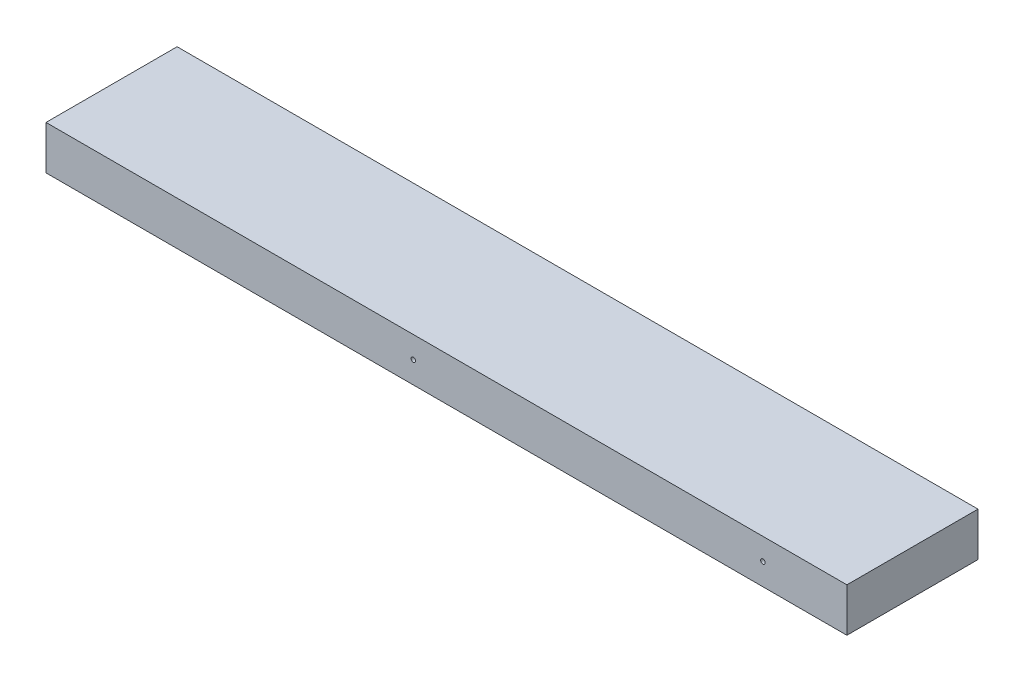
ISO-10303-21;
HEADER;
FILE_DESCRIPTION(('STEP AP214'),'2;1');
FILE_NAME('part.step','',(''),(''),'','','');
FILE_SCHEMA(('AUTOMOTIVE_DESIGN { 1 0 10303 214 1 1 1 1 }'));
ENDSEC;
DATA;
#1=APPLICATION_CONTEXT('core data for automotive mechanical design processes');
#2=APPLICATION_PROTOCOL_DEFINITION('international standard','automotive_design',2000,#1);
#3=PRODUCT_CONTEXT('',#1,'mechanical');
#4=PRODUCT('Part','Part','',(#3));
#5=PRODUCT_RELATED_PRODUCT_CATEGORY('part','',(#4));
#6=PRODUCT_DEFINITION_FORMATION('','',#4);
#7=PRODUCT_DEFINITION_CONTEXT('part definition',#1,'design');
#8=PRODUCT_DEFINITION('design','',#6,#7);
#9=PRODUCT_DEFINITION_SHAPE('','',#8);
#10=(LENGTH_UNIT() NAMED_UNIT(*) SI_UNIT(.MILLI.,.METRE.));
#11=(NAMED_UNIT(*) PLANE_ANGLE_UNIT() SI_UNIT($,.RADIAN.));
#12=(NAMED_UNIT(*) SI_UNIT($,.STERADIAN.) SOLID_ANGLE_UNIT());
#13=UNCERTAINTY_MEASURE_WITH_UNIT(LENGTH_MEASURE(1.E-05),#10,'distance_accuracy_value','');
#14=(GEOMETRIC_REPRESENTATION_CONTEXT(3) GLOBAL_UNCERTAINTY_ASSIGNED_CONTEXT((#13)) GLOBAL_UNIT_ASSIGNED_CONTEXT((#10,
#11,#12)) REPRESENTATION_CONTEXT('',''));
#15=CARTESIAN_POINT('',(0.,0.,0.));
#16=DIRECTION('',(0.,0.,1.));
#17=DIRECTION('',(1.,0.,0.));
#18=AXIS2_PLACEMENT_3D('',#15,#16,#17);
#19=CARTESIAN_POINT('',(-86.3599999999995,5213.35,2683.51));
#20=DIRECTION('',(0.,-1.,0.));
#21=DIRECTION('',(0.,0.,-1.));
#22=AXIS2_PLACEMENT_3D('',#19,#20,#21);
#23=PLANE('',#22);
#24=DIRECTION('',(0.,0.,-1.));
#25=VECTOR('',#24,1.);
#26=CARTESIAN_POINT('',(-96.1779514960055,5213.35,2740.66));
#27=LINE('',#26,#25);
#28=CARTESIAN_POINT('',(-96.1779514960055,5213.35,2740.66));
#29=VERTEX_POINT('',#28);
#30=CARTESIAN_POINT('',(-96.1779514960055,5213.35,2683.51));
#31=VERTEX_POINT('',#30);
#32=EDGE_CURVE('E101',#29,#31,#27,.T.);
#33=ORIENTED_EDGE('',*,*,#32,.F.);
#34=DIRECTION('',(1.,0.,0.));
#35=VECTOR('',#34,1.);
#36=CARTESIAN_POINT('',(-265.815570864871,5213.35,2740.66));
#37=LINE('',#36,#35);
#38=CARTESIAN_POINT('',(-445.271141729743,5213.35,2740.66));
#39=VERTEX_POINT('',#38);
#40=EDGE_CURVE('E106',#39,#29,#37,.T.);
#41=ORIENTED_EDGE('',*,*,#40,.F.);
#42=DIRECTION('',(0.,0.,-1.));
#43=VECTOR('',#42,1.);
#44=CARTESIAN_POINT('',(-445.271141729743,5213.35,2683.51));
#45=LINE('',#44,#43);
#46=CARTESIAN_POINT('',(-445.271141729743,5213.35,2683.51));
#47=VERTEX_POINT('',#46);
#48=EDGE_CURVE('E144',#39,#47,#45,.T.);
#49=ORIENTED_EDGE('',*,*,#48,.T.);
#50=DIRECTION('',(-1.,0.,0.));
#51=VECTOR('',#50,1.);
#52=CARTESIAN_POINT('',(-265.815570864871,5213.35,2683.51));
#53=LINE('',#52,#51);
#54=EDGE_CURVE('E114',#31,#47,#53,.T.);
#55=ORIENTED_EDGE('',*,*,#54,.F.);
#56=EDGE_LOOP('',(#33,#41,#49,#55));
#57=FACE_BOUND('',#56,.T.);
#58=ADVANCED_FACE('F37',(#57),#23,.T.);
#59=CARTESIAN_POINT('',(-265.815570864871,5222.875,2740.66));
#60=DIRECTION('',(0.,0.,-1.));
#61=DIRECTION('',(1.,0.,0.));
#62=AXIS2_PLACEMENT_3D('',#59,#60,#61);
#63=PLANE('',#62);
#64=CARTESIAN_POINT('',(-132.773222798989,5222.875,2740.66));
#65=DIRECTION('',(0.,0.,1.));
#66=DIRECTION('',(1.,0.,0.));
#67=AXIS2_PLACEMENT_3D('',#64,#65,#66);
#68=CIRCLE('',#67,0.991870000000006);
#69=CARTESIAN_POINT('',(-131.781352798989,5222.875,2740.66));
#70=VERTEX_POINT('',#69);
#71=EDGE_CURVE('E40',#70,#70,#68,.T.);
#72=ORIENTED_EDGE('',*,*,#71,.F.);
#73=EDGE_LOOP('',(#72));
#74=FACE_BOUND('',#73,.T.);
#75=CARTESIAN_POINT('',(-285.173222798989,5222.875,2740.66));
#76=DIRECTION('',(0.,0.,1.));
#77=DIRECTION('',(1.,0.,0.));
#78=AXIS2_PLACEMENT_3D('',#75,#76,#77);
#79=CIRCLE('',#78,0.991870000000006);
#80=CARTESIAN_POINT('',(-284.181352798989,5222.875,2740.66));
#81=VERTEX_POINT('',#80);
#82=EDGE_CURVE('E125',#81,#81,#79,.T.);
#83=ORIENTED_EDGE('',*,*,#82,.F.);
#84=EDGE_LOOP('',(#83));
#85=FACE_BOUND('',#84,.T.);
#86=DIRECTION('',(-1.,0.,0.));
#87=VECTOR('',#86,1.);
#88=CARTESIAN_POINT('',(-445.271141729743,5232.4,2740.66));
#89=LINE('',#88,#87);
#90=CARTESIAN_POINT('',(-96.1779514960055,5232.4,2740.66));
#91=VERTEX_POINT('',#90);
#92=CARTESIAN_POINT('',(-445.271141729743,5232.4,2740.66));
#93=VERTEX_POINT('',#92);
#94=EDGE_CURVE('E138',#91,#93,#89,.T.);
#95=ORIENTED_EDGE('',*,*,#94,.T.);
#96=DIRECTION('',(0.,1.,0.));
#97=VECTOR('',#96,1.);
#98=CARTESIAN_POINT('',(-445.271141729743,5213.35,2740.66));
#99=LINE('',#98,#97);
#100=EDGE_CURVE('E74',#93,#39,#99,.F.);
#101=ORIENTED_EDGE('',*,*,#100,.T.);
#102=ORIENTED_EDGE('',*,*,#40,.T.);
#103=DIRECTION('',(0.,-1.,0.));
#104=VECTOR('',#103,1.);
#105=CARTESIAN_POINT('',(-96.1779514960055,5213.35,2740.66));
#106=LINE('',#105,#104);
#107=EDGE_CURVE('E98',#91,#29,#106,.T.);
#108=ORIENTED_EDGE('',*,*,#107,.F.);
#109=EDGE_LOOP('',(#95,#101,#102,#108));
#110=FACE_BOUND('',#109,.T.);
#111=ADVANCED_FACE('F107',(#74,#85,#110),#63,.F.);
#112=CARTESIAN_POINT('',(-445.271141729743,5213.35,2683.51));
#113=DIRECTION('',(-1.,0.,0.));
#114=DIRECTION('',(0.,0.,-1.));
#115=AXIS2_PLACEMENT_3D('',#112,#113,#114);
#116=PLANE('',#115);
#117=DIRECTION('',(0.,1.,0.));
#118=VECTOR('',#117,1.);
#119=CARTESIAN_POINT('',(-445.271141729743,5222.875,2683.51));
#120=LINE('',#119,#118);
#121=CARTESIAN_POINT('',(-445.271141729743,5232.4,2683.51));
#122=VERTEX_POINT('',#121);
#123=EDGE_CURVE('E140',#47,#122,#120,.T.);
#124=ORIENTED_EDGE('',*,*,#123,.F.);
#125=ORIENTED_EDGE('',*,*,#48,.F.);
#126=ORIENTED_EDGE('',*,*,#100,.F.);
#127=DIRECTION('',(0.,0.,1.));
#128=VECTOR('',#127,1.);
#129=CARTESIAN_POINT('',(-445.271141729743,5232.4,2683.51));
#130=LINE('',#129,#128);
#131=EDGE_CURVE('E45',#93,#122,#130,.F.);
#132=ORIENTED_EDGE('',*,*,#131,.T.);
#133=EDGE_LOOP('',(#124,#125,#126,#132));
#134=FACE_BOUND('',#133,.T.);
#135=ADVANCED_FACE('F158',(#134),#116,.T.);
#136=CARTESIAN_POINT('',(-265.815570864871,5222.875,2683.51));
#137=DIRECTION('',(0.,0.,1.));
#138=DIRECTION('',(-1.,0.,0.));
#139=AXIS2_PLACEMENT_3D('',#136,#137,#138);
#140=PLANE('',#139);
#141=CARTESIAN_POINT('',(-412.173222798989,5222.875,2683.51));
#142=DIRECTION('',(0.,0.,-1.));
#143=DIRECTION('',(-1.,0.,0.));
#144=AXIS2_PLACEMENT_3D('',#141,#142,#143);
#145=CIRCLE('',#144,0.991870000000006);
#146=CARTESIAN_POINT('',(-413.165092798989,5222.875,2683.51));
#147=VERTEX_POINT('',#146);
#148=EDGE_CURVE('E129',#147,#147,#145,.T.);
#149=ORIENTED_EDGE('',*,*,#148,.F.);
#150=EDGE_LOOP('',(#149));
#151=FACE_BOUND('',#150,.T.);
#152=CARTESIAN_POINT('',(-310.573222798989,5222.875,2683.51));
#153=DIRECTION('',(0.,0.,-1.));
#154=DIRECTION('',(-1.,0.,0.));
#155=AXIS2_PLACEMENT_3D('',#152,#153,#154);
#156=CIRCLE('',#155,0.991870000000006);
#157=CARTESIAN_POINT('',(-311.565092798989,5222.875,2683.51));
#158=VERTEX_POINT('',#157);
#159=EDGE_CURVE('E133',#158,#158,#156,.T.);
#160=ORIENTED_EDGE('',*,*,#159,.F.);
#161=EDGE_LOOP('',(#160));
#162=FACE_BOUND('',#161,.T.);
#163=CARTESIAN_POINT('',(-107.373222798989,5222.875,2683.51));
#164=DIRECTION('',(0.,0.,-1.));
#165=DIRECTION('',(-1.,0.,0.));
#166=AXIS2_PLACEMENT_3D('',#163,#164,#165);
#167=CIRCLE('',#166,0.991870000000006);
#168=CARTESIAN_POINT('',(-108.365092798989,5222.875,2683.51));
#169=VERTEX_POINT('',#168);
#170=EDGE_CURVE('E110',#169,#169,#167,.T.);
#171=ORIENTED_EDGE('',*,*,#170,.F.);
#172=EDGE_LOOP('',(#171));
#173=FACE_BOUND('',#172,.T.);
#174=ORIENTED_EDGE('',*,*,#54,.T.);
#175=ORIENTED_EDGE('',*,*,#123,.T.);
#176=DIRECTION('',(-1.,0.,0.));
#177=VECTOR('',#176,1.);
#178=CARTESIAN_POINT('',(-445.271141729743,5232.4,2683.51));
#179=LINE('',#178,#177);
#180=CARTESIAN_POINT('',(-96.1779514960055,5232.4,2683.51));
#181=VERTEX_POINT('',#180);
#182=EDGE_CURVE('E11',#122,#181,#179,.F.);
#183=ORIENTED_EDGE('',*,*,#182,.T.);
#184=DIRECTION('',(0.,-1.,0.));
#185=VECTOR('',#184,1.);
#186=CARTESIAN_POINT('',(-96.1779514960055,5213.35,2683.51));
#187=LINE('',#186,#185);
#188=EDGE_CURVE('E103',#181,#31,#187,.T.);
#189=ORIENTED_EDGE('',*,*,#188,.T.);
#190=EDGE_LOOP('',(#174,#175,#183,#189));
#191=FACE_BOUND('',#190,.T.);
#192=ADVANCED_FACE('F164',(#151,#162,#173,#191),#140,.F.);
#193=CARTESIAN_POINT('',(-445.271141729743,5232.4,2683.51));
#194=DIRECTION('',(0.,1.,0.));
#195=DIRECTION('',(0.,0.,1.));
#196=AXIS2_PLACEMENT_3D('',#193,#194,#195);
#197=PLANE('',#196);
#198=DIRECTION('',(0.,0.,-1.));
#199=VECTOR('',#198,1.);
#200=CARTESIAN_POINT('',(-96.1779514960055,5232.4,2740.66));
#201=LINE('',#200,#199);
#202=EDGE_CURVE('E53',#91,#181,#201,.T.);
#203=ORIENTED_EDGE('',*,*,#202,.T.);
#204=ORIENTED_EDGE('',*,*,#182,.F.);
#205=ORIENTED_EDGE('',*,*,#131,.F.);
#206=ORIENTED_EDGE('',*,*,#94,.F.);
#207=EDGE_LOOP('',(#203,#204,#205,#206));
#208=FACE_BOUND('',#207,.T.);
#209=ADVANCED_FACE('F171',(#208),#197,.T.);
#210=CARTESIAN_POINT('',(-107.373222798989,5222.875,2664.46));
#211=DIRECTION('',(0.,0.,-1.));
#212=DIRECTION('',(1.,0.,0.));
#213=AXIS2_PLACEMENT_3D('',#210,#211,#212);
#214=CYLINDRICAL_SURFACE('',#213,0.991870000000006);
#215=CARTESIAN_POINT('',(-107.373222798989,5222.875,2702.56));
#216=DIRECTION('',(0.,0.,1.));
#217=DIRECTION('',(1.,0.,0.));
#218=AXIS2_PLACEMENT_3D('',#215,#216,#217);
#219=CIRCLE('',#218,0.991870000000006);
#220=CARTESIAN_POINT('',(-106.381352798989,5222.875,2702.56));
#221=VERTEX_POINT('',#220);
#222=EDGE_CURVE('E134',#221,#221,#219,.T.);
#223=ORIENTED_EDGE('',*,*,#222,.T.);
#224=EDGE_LOOP('',(#223));
#225=FACE_BOUND('',#224,.T.);
#226=ORIENTED_EDGE('',*,*,#170,.T.);
#227=EDGE_LOOP('',(#226));
#228=FACE_BOUND('',#227,.T.);
#229=ADVANCED_FACE('F175',(#225,#228),#214,.F.);
#230=CARTESIAN_POINT('',(-107.373222798989,5222.875,2702.56));
#231=DIRECTION('',(0.,0.,-1.));
#232=DIRECTION('',(1.,0.,0.));
#233=AXIS2_PLACEMENT_3D('',#230,#231,#232);
#234=CONICAL_SURFACE('',#233,0.991870000000006,1.02974425867677);
#235=CARTESIAN_POINT('',(-107.373222798989,5222.875,2703.1559756222));
#236=VERTEX_POINT('',#235);
#237=VERTEX_LOOP('',#236);
#238=FACE_BOUND('',#237,.T.);
#239=ORIENTED_EDGE('',*,*,#222,.F.);
#240=EDGE_LOOP('',(#239));
#241=FACE_BOUND('',#240,.T.);
#242=ADVANCED_FACE('F176',(#238,#241),#234,.F.);
#243=CARTESIAN_POINT('',(-310.573222798989,5222.875,2664.46));
#244=DIRECTION('',(0.,0.,-1.));
#245=DIRECTION('',(1.,0.,0.));
#246=AXIS2_PLACEMENT_3D('',#243,#244,#245);
#247=CYLINDRICAL_SURFACE('',#246,0.991870000000006);
#248=CARTESIAN_POINT('',(-310.573222798989,5222.875,2702.56));
#249=DIRECTION('',(0.,0.,1.));
#250=DIRECTION('',(1.,0.,0.));
#251=AXIS2_PLACEMENT_3D('',#248,#249,#250);
#252=CIRCLE('',#251,0.991870000000006);
#253=CARTESIAN_POINT('',(-309.581352798989,5222.875,2702.56));
#254=VERTEX_POINT('',#253);
#255=EDGE_CURVE('E130',#254,#254,#252,.T.);
#256=ORIENTED_EDGE('',*,*,#255,.T.);
#257=EDGE_LOOP('',(#256));
#258=FACE_BOUND('',#257,.T.);
#259=ORIENTED_EDGE('',*,*,#159,.T.);
#260=EDGE_LOOP('',(#259));
#261=FACE_BOUND('',#260,.T.);
#262=ADVANCED_FACE('F179',(#258,#261),#247,.F.);
#263=CARTESIAN_POINT('',(-310.573222798989,5222.875,2702.56));
#264=DIRECTION('',(0.,0.,-1.));
#265=DIRECTION('',(1.,0.,0.));
#266=AXIS2_PLACEMENT_3D('',#263,#264,#265);
#267=CONICAL_SURFACE('',#266,0.991870000000006,1.02974425867677);
#268=CARTESIAN_POINT('',(-310.573222798989,5222.875,2703.1559756222));
#269=VERTEX_POINT('',#268);
#270=VERTEX_LOOP('',#269);
#271=FACE_BOUND('',#270,.T.);
#272=ORIENTED_EDGE('',*,*,#255,.F.);
#273=EDGE_LOOP('',(#272));
#274=FACE_BOUND('',#273,.T.);
#275=ADVANCED_FACE('F183',(#271,#274),#267,.F.);
#276=CARTESIAN_POINT('',(-412.173222798989,5222.875,2664.46));
#277=DIRECTION('',(0.,0.,-1.));
#278=DIRECTION('',(1.,0.,0.));
#279=AXIS2_PLACEMENT_3D('',#276,#277,#278);
#280=CYLINDRICAL_SURFACE('',#279,0.991870000000006);
#281=CARTESIAN_POINT('',(-412.173222798989,5222.875,2702.56));
#282=DIRECTION('',(0.,0.,1.));
#283=DIRECTION('',(1.,0.,0.));
#284=AXIS2_PLACEMENT_3D('',#281,#282,#283);
#285=CIRCLE('',#284,0.991870000000006);
#286=CARTESIAN_POINT('',(-411.181352798989,5222.875,2702.56));
#287=VERTEX_POINT('',#286);
#288=EDGE_CURVE('E126',#287,#287,#285,.T.);
#289=ORIENTED_EDGE('',*,*,#288,.T.);
#290=EDGE_LOOP('',(#289));
#291=FACE_BOUND('',#290,.T.);
#292=ORIENTED_EDGE('',*,*,#148,.T.);
#293=EDGE_LOOP('',(#292));
#294=FACE_BOUND('',#293,.T.);
#295=ADVANCED_FACE('F186',(#291,#294),#280,.F.);
#296=CARTESIAN_POINT('',(-412.173222798989,5222.875,2702.56));
#297=DIRECTION('',(0.,0.,-1.));
#298=DIRECTION('',(1.,0.,0.));
#299=AXIS2_PLACEMENT_3D('',#296,#297,#298);
#300=CONICAL_SURFACE('',#299,0.991870000000006,1.02974425867677);
#301=CARTESIAN_POINT('',(-412.173222798989,5222.875,2703.1559756222));
#302=VERTEX_POINT('',#301);
#303=VERTEX_LOOP('',#302);
#304=FACE_BOUND('',#303,.T.);
#305=ORIENTED_EDGE('',*,*,#288,.F.);
#306=EDGE_LOOP('',(#305));
#307=FACE_BOUND('',#306,.T.);
#308=ADVANCED_FACE('F190',(#304,#307),#300,.F.);
#309=CARTESIAN_POINT('',(-285.173222798989,5222.875,2759.71000000001));
#310=DIRECTION('',(0.,0.,1.));
#311=DIRECTION('',(-1.,0.,0.));
#312=AXIS2_PLACEMENT_3D('',#309,#310,#311);
#313=CYLINDRICAL_SURFACE('',#312,0.991870000000006);
#314=CARTESIAN_POINT('',(-285.173222798989,5222.875,2721.61000000001));
#315=DIRECTION('',(0.,0.,-1.));
#316=DIRECTION('',(-1.,0.,0.));
#317=AXIS2_PLACEMENT_3D('',#314,#315,#316);
#318=CIRCLE('',#317,0.991870000000006);
#319=CARTESIAN_POINT('',(-286.165092798989,5222.875,2721.61000000001));
#320=VERTEX_POINT('',#319);
#321=EDGE_CURVE('E122',#320,#320,#318,.T.);
#322=ORIENTED_EDGE('',*,*,#321,.T.);
#323=EDGE_LOOP('',(#322));
#324=FACE_BOUND('',#323,.T.);
#325=ORIENTED_EDGE('',*,*,#82,.T.);
#326=EDGE_LOOP('',(#325));
#327=FACE_BOUND('',#326,.T.);
#328=ADVANCED_FACE('F155',(#324,#327),#313,.F.);
#329=CARTESIAN_POINT('',(-285.173222798989,5222.875,2721.61000000001));
#330=DIRECTION('',(0.,0.,1.));
#331=DIRECTION('',(-1.,0.,0.));
#332=AXIS2_PLACEMENT_3D('',#329,#330,#331);
#333=CONICAL_SURFACE('',#332,0.991870000000006,1.02974425867677);
#334=CARTESIAN_POINT('',(-285.173222798989,5222.875,2721.01402437781));
#335=VERTEX_POINT('',#334);
#336=VERTEX_LOOP('',#335);
#337=FACE_BOUND('',#336,.T.);
#338=ORIENTED_EDGE('',*,*,#321,.F.);
#339=EDGE_LOOP('',(#338));
#340=FACE_BOUND('',#339,.T.);
#341=ADVANCED_FACE('F197',(#337,#340),#333,.F.);
#342=CARTESIAN_POINT('',(-132.773222798989,5222.875,2759.71000000001));
#343=DIRECTION('',(0.,0.,1.));
#344=DIRECTION('',(-1.,0.,0.));
#345=AXIS2_PLACEMENT_3D('',#342,#343,#344);
#346=CYLINDRICAL_SURFACE('',#345,0.991870000000006);
#347=CARTESIAN_POINT('',(-132.773222798989,5222.875,2721.61000000001));
#348=DIRECTION('',(0.,0.,-1.));
#349=DIRECTION('',(-1.,0.,0.));
#350=AXIS2_PLACEMENT_3D('',#347,#348,#349);
#351=CIRCLE('',#350,0.991870000000006);
#352=CARTESIAN_POINT('',(-133.765092798989,5222.875,2721.61000000001));
#353=VERTEX_POINT('',#352);
#354=EDGE_CURVE('E115',#353,#353,#351,.T.);
#355=ORIENTED_EDGE('',*,*,#354,.T.);
#356=EDGE_LOOP('',(#355));
#357=FACE_BOUND('',#356,.T.);
#358=ORIENTED_EDGE('',*,*,#71,.T.);
#359=EDGE_LOOP('',(#358));
#360=FACE_BOUND('',#359,.T.);
#361=ADVANCED_FACE('F200',(#357,#360),#346,.F.);
#362=CARTESIAN_POINT('',(-132.773222798989,5222.875,2721.61000000001));
#363=DIRECTION('',(0.,0.,1.));
#364=DIRECTION('',(-1.,0.,0.));
#365=AXIS2_PLACEMENT_3D('',#362,#363,#364);
#366=CONICAL_SURFACE('',#365,0.991870000000006,1.02974425867677);
#367=CARTESIAN_POINT('',(-132.773222798989,5222.875,2721.01402437781));
#368=VERTEX_POINT('',#367);
#369=VERTEX_LOOP('',#368);
#370=FACE_BOUND('',#369,.T.);
#371=ORIENTED_EDGE('',*,*,#354,.F.);
#372=EDGE_LOOP('',(#371));
#373=FACE_BOUND('',#372,.T.);
#374=ADVANCED_FACE('F205',(#370,#373),#366,.F.);
#375=CARTESIAN_POINT('',(-96.1779514960055,5213.35,2740.66));
#376=DIRECTION('',(-1.,0.,0.));
#377=DIRECTION('',(0.,0.,-1.));
#378=AXIS2_PLACEMENT_3D('',#375,#376,#377);
#379=PLANE('',#378);
#380=ORIENTED_EDGE('',*,*,#188,.F.);
#381=ORIENTED_EDGE('',*,*,#202,.F.);
#382=ORIENTED_EDGE('',*,*,#107,.T.);
#383=ORIENTED_EDGE('',*,*,#32,.T.);
#384=EDGE_LOOP('',(#380,#381,#382,#383));
#385=FACE_BOUND('',#384,.T.);
#386=ADVANCED_FACE('F99',(#385),#379,.F.);
#387=CLOSED_SHELL('',(#58,#111,#135,#192,#209,#229,#242,#262,#275,#295,#308,#328,#341,#361,#374,#386));
#388=MANIFOLD_SOLID_BREP('B2',#387);
#389=ADVANCED_BREP_SHAPE_REPRESENTATION('',(#18,#388),#14);
#390=SHAPE_DEFINITION_REPRESENTATION(#9,#389);
ENDSEC;
END-ISO-10303-21;
